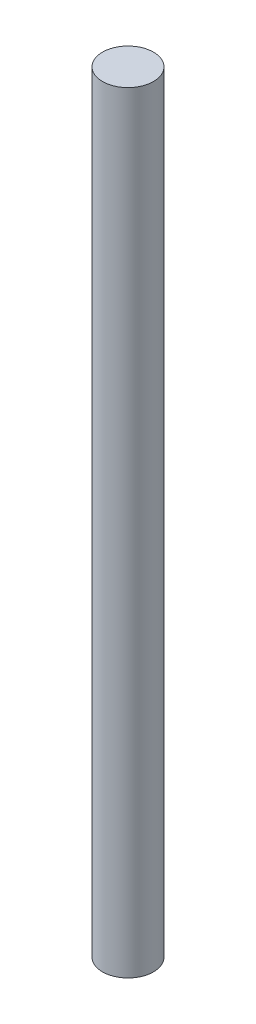
ISO-10303-21;
HEADER;
FILE_DESCRIPTION(('STEP AP214'),'2;1');
FILE_NAME('part.step','',(''),(''),'','','');
FILE_SCHEMA(('AUTOMOTIVE_DESIGN { 1 0 10303 214 1 1 1 1 }'));
ENDSEC;
DATA;
#1=APPLICATION_CONTEXT('core data for automotive mechanical design processes');
#2=APPLICATION_PROTOCOL_DEFINITION('international standard','automotive_design',2000,#1);
#3=PRODUCT_CONTEXT('',#1,'mechanical');
#4=PRODUCT('Part','Part','',(#3));
#5=PRODUCT_RELATED_PRODUCT_CATEGORY('part','',(#4));
#6=PRODUCT_DEFINITION_FORMATION('','',#4);
#7=PRODUCT_DEFINITION_CONTEXT('part definition',#1,'design');
#8=PRODUCT_DEFINITION('design','',#6,#7);
#9=PRODUCT_DEFINITION_SHAPE('','',#8);
#10=(LENGTH_UNIT() NAMED_UNIT(*) SI_UNIT(.MILLI.,.METRE.));
#11=(NAMED_UNIT(*) PLANE_ANGLE_UNIT() SI_UNIT($,.RADIAN.));
#12=(NAMED_UNIT(*) SI_UNIT($,.STERADIAN.) SOLID_ANGLE_UNIT());
#13=UNCERTAINTY_MEASURE_WITH_UNIT(LENGTH_MEASURE(1.E-05),#10,'distance_accuracy_value','');
#14=(GEOMETRIC_REPRESENTATION_CONTEXT(3) GLOBAL_UNCERTAINTY_ASSIGNED_CONTEXT((#13)) GLOBAL_UNIT_ASSIGNED_CONTEXT((#10,
#11,#12)) REPRESENTATION_CONTEXT('',''));
#15=CARTESIAN_POINT('',(0.,0.,0.));
#16=DIRECTION('',(0.,0.,1.));
#17=DIRECTION('',(1.,0.,0.));
#18=AXIS2_PLACEMENT_3D('',#15,#16,#17);
#19=CARTESIAN_POINT('',(0.,118.,0.));
#20=DIRECTION('',(0.,-1.,0.));
#21=DIRECTION('',(0.,0.,-1.));
#22=AXIS2_PLACEMENT_3D('',#19,#20,#21);
#23=CYLINDRICAL_SURFACE('',#22,3.9);
#24=CARTESIAN_POINT('',(0.,118.,0.));
#25=DIRECTION('',(0.,1.,0.));
#26=DIRECTION('',(0.,0.,1.));
#27=AXIS2_PLACEMENT_3D('',#24,#25,#26);
#28=CIRCLE('',#27,3.9);
#29=CARTESIAN_POINT('',(0.,118.,3.9));
#30=VERTEX_POINT('',#29);
#31=EDGE_CURVE('E10',#30,#30,#28,.T.);
#32=ORIENTED_EDGE('',*,*,#31,.F.);
#33=EDGE_LOOP('',(#32));
#34=FACE_BOUND('',#33,.T.);
#35=CARTESIAN_POINT('',(0.,0.,0.));
#36=DIRECTION('',(0.,1.,0.));
#37=DIRECTION('',(0.,0.,1.));
#38=AXIS2_PLACEMENT_3D('',#35,#36,#37);
#39=CIRCLE('',#38,3.9);
#40=CARTESIAN_POINT('',(0.,0.,3.9));
#41=VERTEX_POINT('',#40);
#42=EDGE_CURVE('E40',#41,#41,#39,.T.);
#43=ORIENTED_EDGE('',*,*,#42,.T.);
#44=EDGE_LOOP('',(#43));
#45=FACE_BOUND('',#44,.T.);
#46=ADVANCED_FACE('F37',(#34,#45),#23,.T.);
#47=CARTESIAN_POINT('',(0.,118.,0.));
#48=DIRECTION('',(0.,1.,0.));
#49=DIRECTION('',(0.,0.,1.));
#50=AXIS2_PLACEMENT_3D('',#47,#48,#49);
#51=PLANE('',#50);
#52=ORIENTED_EDGE('',*,*,#31,.T.);
#53=EDGE_LOOP('',(#52));
#54=FACE_BOUND('',#53,.T.);
#55=ADVANCED_FACE('F52',(#54),#51,.T.);
#56=CARTESIAN_POINT('',(0.,0.,0.));
#57=DIRECTION('',(0.,1.,0.));
#58=DIRECTION('',(0.,0.,1.));
#59=AXIS2_PLACEMENT_3D('',#56,#57,#58);
#60=PLANE('',#59);
#61=ORIENTED_EDGE('',*,*,#42,.F.);
#62=EDGE_LOOP('',(#61));
#63=FACE_BOUND('',#62,.T.);
#64=ADVANCED_FACE('F50',(#63),#60,.F.);
#65=CLOSED_SHELL('',(#46,#55,#64));
#66=MANIFOLD_SOLID_BREP('B2',#65);
#67=ADVANCED_BREP_SHAPE_REPRESENTATION('',(#18,#66),#14);
#68=SHAPE_DEFINITION_REPRESENTATION(#9,#67);
ENDSEC;
END-ISO-10303-21;
